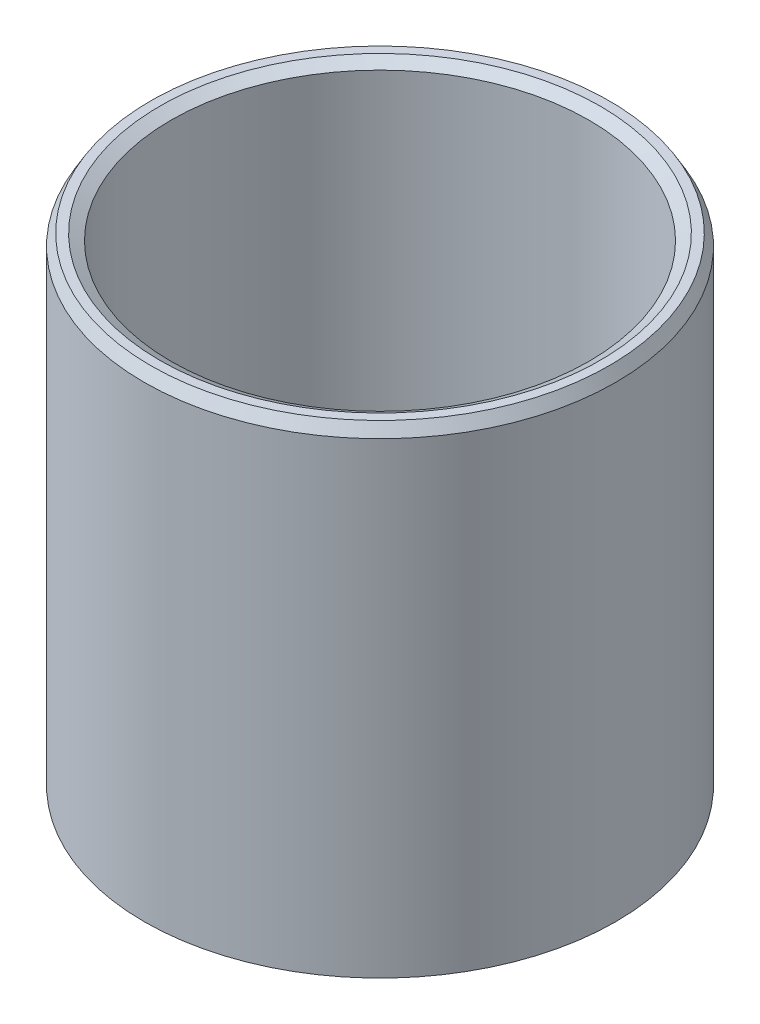
ISO-10303-21;
HEADER;
FILE_DESCRIPTION(('STEP AP214'),'2;1');
FILE_NAME('part.step','',(''),(''),'','','');
FILE_SCHEMA(('AUTOMOTIVE_DESIGN { 1 0 10303 214 1 1 1 1 }'));
ENDSEC;
DATA;
#1=APPLICATION_CONTEXT('core data for automotive mechanical design processes');
#2=APPLICATION_PROTOCOL_DEFINITION('international standard','automotive_design',2000,#1);
#3=PRODUCT_CONTEXT('',#1,'mechanical');
#4=PRODUCT('Part','Part','',(#3));
#5=PRODUCT_RELATED_PRODUCT_CATEGORY('part','',(#4));
#6=PRODUCT_DEFINITION_FORMATION('','',#4);
#7=PRODUCT_DEFINITION_CONTEXT('part definition',#1,'design');
#8=PRODUCT_DEFINITION('design','',#6,#7);
#9=PRODUCT_DEFINITION_SHAPE('','',#8);
#10=(LENGTH_UNIT() NAMED_UNIT(*) SI_UNIT(.MILLI.,.METRE.));
#11=(NAMED_UNIT(*) PLANE_ANGLE_UNIT() SI_UNIT($,.RADIAN.));
#12=(NAMED_UNIT(*) SI_UNIT($,.STERADIAN.) SOLID_ANGLE_UNIT());
#13=UNCERTAINTY_MEASURE_WITH_UNIT(LENGTH_MEASURE(1.E-05),#10,'distance_accuracy_value','');
#14=(GEOMETRIC_REPRESENTATION_CONTEXT(3) GLOBAL_UNCERTAINTY_ASSIGNED_CONTEXT((#13)) GLOBAL_UNIT_ASSIGNED_CONTEXT((#10,
#11,#12)) REPRESENTATION_CONTEXT('',''));
#15=CARTESIAN_POINT('',(0.,0.,0.));
#16=DIRECTION('',(0.,0.,1.));
#17=DIRECTION('',(1.,0.,0.));
#18=AXIS2_PLACEMENT_3D('',#15,#16,#17);
#19=CARTESIAN_POINT('',(0.,87.3822636963813,0.));
#20=DIRECTION('',(0.,-1.,0.));
#21=DIRECTION('',(0.,0.,-1.));
#22=AXIS2_PLACEMENT_3D('',#19,#20,#21);
#23=CYLINDRICAL_SURFACE('',#22,42.5);
#24=CARTESIAN_POINT('',(0.,1.1693254512596,0.));
#25=DIRECTION('',(0.,1.,0.));
#26=DIRECTION('',(0.,0.,1.));
#27=AXIS2_PLACEMENT_3D('',#24,#25,#26);
#28=CIRCLE('',#27,42.5);
#29=CARTESIAN_POINT('',(0.,1.1693254512596,42.5));
#30=VERTEX_POINT('',#29);
#31=EDGE_CURVE('E10',#30,#30,#28,.T.);
#32=ORIENTED_EDGE('',*,*,#31,.T.);
#33=EDGE_LOOP('',(#32));
#34=FACE_BOUND('',#33,.T.);
#35=CARTESIAN_POINT('',(0.,85.3569326042162,0.));
#36=DIRECTION('',(0.,1.,0.));
#37=DIRECTION('',(0.,0.,1.));
#38=AXIS2_PLACEMENT_3D('',#35,#36,#37);
#39=CIRCLE('',#38,42.5);
#40=CARTESIAN_POINT('',(0.,85.3569326042162,42.5));
#41=VERTEX_POINT('',#40);
#42=EDGE_CURVE('E50',#41,#41,#39,.F.);
#43=ORIENTED_EDGE('',*,*,#42,.T.);
#44=EDGE_LOOP('',(#43));
#45=FACE_BOUND('',#44,.T.);
#46=ADVANCED_FACE('F39',(#34,#45),#23,.T.);
#47=CARTESIAN_POINT('',(0.,87.3822636963813,0.));
#48=DIRECTION('',(0.,1.,0.));
#49=DIRECTION('',(0.,0.,1.));
#50=AXIS2_PLACEMENT_3D('',#47,#48,#49);
#51=PLANE('',#50);
#52=CARTESIAN_POINT('',(0.,87.3822636963813,0.));
#53=DIRECTION('',(0.,1.,0.));
#54=DIRECTION('',(0.,0.,1.));
#55=AXIS2_PLACEMENT_3D('',#52,#53,#54);
#56=CIRCLE('',#55,39.687475728904);
#57=CARTESIAN_POINT('',(0.,87.3822636963813,39.687475728904));
#58=VERTEX_POINT('',#57);
#59=EDGE_CURVE('E58',#58,#58,#56,.F.);
#60=ORIENTED_EDGE('',*,*,#59,.T.);
#61=EDGE_LOOP('',(#60));
#62=FACE_BOUND('',#61,.T.);
#63=CARTESIAN_POINT('',(0.,87.3822636963813,0.));
#64=DIRECTION('',(0.,1.,0.));
#65=DIRECTION('',(0.,0.,1.));
#66=AXIS2_PLACEMENT_3D('',#63,#64,#65);
#67=CIRCLE('',#66,41.3306745487404);
#68=CARTESIAN_POINT('',(0.,87.3822636963813,41.3306745487404));
#69=VERTEX_POINT('',#68);
#70=EDGE_CURVE('E61',#69,#69,#67,.T.);
#71=ORIENTED_EDGE('',*,*,#70,.T.);
#72=EDGE_LOOP('',(#71));
#73=FACE_BOUND('',#72,.T.);
#74=ADVANCED_FACE('F88',(#62,#73),#51,.T.);
#75=CARTESIAN_POINT('',(0.,0.,0.));
#76=DIRECTION('',(0.,1.,0.));
#77=DIRECTION('',(0.,0.,1.));
#78=AXIS2_PLACEMENT_3D('',#75,#76,#77);
#79=PLANE('',#78);
#80=CARTESIAN_POINT('',(0.,0.,0.));
#81=DIRECTION('',(0.,1.,0.));
#82=DIRECTION('',(0.,0.,1.));
#83=AXIS2_PLACEMENT_3D('',#80,#81,#82);
#84=CIRCLE('',#83,38.8314700879987);
#85=CARTESIAN_POINT('',(0.,0.,38.8314700879987));
#86=VERTEX_POINT('',#85);
#87=EDGE_CURVE('E51',#86,#86,#84,.T.);
#88=ORIENTED_EDGE('',*,*,#87,.T.);
#89=EDGE_LOOP('',(#88));
#90=FACE_BOUND('',#89,.T.);
#91=CARTESIAN_POINT('',(0.,0.,0.));
#92=DIRECTION('',(0.,1.,0.));
#93=DIRECTION('',(0.,0.,1.));
#94=AXIS2_PLACEMENT_3D('',#91,#92,#93);
#95=CIRCLE('',#94,40.474668907835);
#96=CARTESIAN_POINT('',(0.,0.,40.474668907835));
#97=VERTEX_POINT('',#96);
#98=EDGE_CURVE('E54',#97,#97,#95,.F.);
#99=ORIENTED_EDGE('',*,*,#98,.T.);
#100=EDGE_LOOP('',(#99));
#101=FACE_BOUND('',#100,.T.);
#102=ADVANCED_FACE('F83',(#90,#101),#79,.F.);
#103=CARTESIAN_POINT('',(0.,87.3822636963813,0.));
#104=DIRECTION('',(0.,-1.,0.));
#105=DIRECTION('',(0.,0.,-1.));
#106=AXIS2_PLACEMENT_3D('',#103,#104,#105);
#107=CYLINDRICAL_SURFACE('',#106,37.6621446367391);
#108=CARTESIAN_POINT('',(0.,86.2129382451217,0.));
#109=DIRECTION('',(0.,1.,0.));
#110=DIRECTION('',(0.,0.,1.));
#111=AXIS2_PLACEMENT_3D('',#108,#109,#110);
#112=CIRCLE('',#111,37.6621446367391);
#113=CARTESIAN_POINT('',(0.,86.2129382451217,37.6621446367391));
#114=VERTEX_POINT('',#113);
#115=EDGE_CURVE('E67',#114,#114,#112,.T.);
#116=ORIENTED_EDGE('',*,*,#115,.T.);
#117=EDGE_LOOP('',(#116));
#118=FACE_BOUND('',#117,.T.);
#119=CARTESIAN_POINT('',(0.,2.02533109216507,0.));
#120=DIRECTION('',(0.,1.,0.));
#121=DIRECTION('',(0.,0.,1.));
#122=AXIS2_PLACEMENT_3D('',#119,#120,#121);
#123=CIRCLE('',#122,37.6621446367391);
#124=CARTESIAN_POINT('',(0.,2.02533109216507,37.6621446367391));
#125=VERTEX_POINT('',#124);
#126=EDGE_CURVE('E69',#125,#125,#123,.F.);
#127=ORIENTED_EDGE('',*,*,#126,.T.);
#128=EDGE_LOOP('',(#127));
#129=FACE_BOUND('',#128,.T.);
#130=ADVANCED_FACE('F71',(#118,#129),#107,.F.);
#131=CARTESIAN_POINT('',(0.,86.2129382451217,0.));
#132=DIRECTION('',(0.,1.,0.));
#133=DIRECTION('',(0.,0.,1.));
#134=AXIS2_PLACEMENT_3D('',#131,#132,#133);
#135=CONICAL_SURFACE('',#134,37.6621446367391,1.0471975511966);
#136=ORIENTED_EDGE('',*,*,#59,.F.);
#137=EDGE_LOOP('',(#136));
#138=FACE_BOUND('',#137,.T.);
#139=ORIENTED_EDGE('',*,*,#115,.F.);
#140=EDGE_LOOP('',(#139));
#141=FACE_BOUND('',#140,.T.);
#142=ADVANCED_FACE('F77',(#138,#141),#135,.F.);
#143=CARTESIAN_POINT('',(0.,0.,0.));
#144=DIRECTION('',(0.,-1.,0.));
#145=DIRECTION('',(0.,0.,-1.));
#146=AXIS2_PLACEMENT_3D('',#143,#144,#145);
#147=CONICAL_SURFACE('',#146,38.8314700879987,0.523598775598297);
#148=ORIENTED_EDGE('',*,*,#126,.F.);
#149=EDGE_LOOP('',(#148));
#150=FACE_BOUND('',#149,.T.);
#151=ORIENTED_EDGE('',*,*,#87,.F.);
#152=EDGE_LOOP('',(#151));
#153=FACE_BOUND('',#152,.T.);
#154=ADVANCED_FACE('F73',(#150,#153),#147,.F.);
#155=CARTESIAN_POINT('',(0.,1.1693254512596,0.));
#156=DIRECTION('',(0.,1.,0.));
#157=DIRECTION('',(0.,0.,1.));
#158=AXIS2_PLACEMENT_3D('',#155,#156,#157);
#159=CONICAL_SURFACE('',#158,42.5,1.0471975511966);
#160=ORIENTED_EDGE('',*,*,#98,.F.);
#161=EDGE_LOOP('',(#160));
#162=FACE_BOUND('',#161,.T.);
#163=ORIENTED_EDGE('',*,*,#31,.F.);
#164=EDGE_LOOP('',(#163));
#165=FACE_BOUND('',#164,.T.);
#166=ADVANCED_FACE('F76',(#162,#165),#159,.T.);
#167=CARTESIAN_POINT('',(0.,87.3822636963813,0.));
#168=DIRECTION('',(0.,-1.,0.));
#169=DIRECTION('',(0.,0.,-1.));
#170=AXIS2_PLACEMENT_3D('',#167,#168,#169);
#171=CONICAL_SURFACE('',#170,41.3306745487404,0.523598775598298);
#172=ORIENTED_EDGE('',*,*,#42,.F.);
#173=EDGE_LOOP('',(#172));
#174=FACE_BOUND('',#173,.T.);
#175=ORIENTED_EDGE('',*,*,#70,.F.);
#176=EDGE_LOOP('',(#175));
#177=FACE_BOUND('',#176,.T.);
#178=ADVANCED_FACE('F45',(#174,#177),#171,.T.);
#179=CLOSED_SHELL('',(#46,#74,#102,#130,#142,#154,#166,#178));
#180=MANIFOLD_SOLID_BREP('B2',#179);
#181=ADVANCED_BREP_SHAPE_REPRESENTATION('',(#18,#180),#14);
#182=SHAPE_DEFINITION_REPRESENTATION(#9,#181);
ENDSEC;
END-ISO-10303-21;
